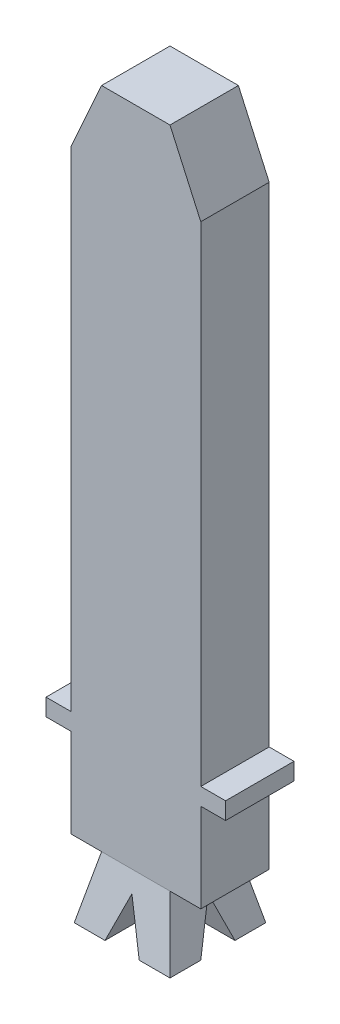
ISO-10303-21;
HEADER;
FILE_DESCRIPTION(('STEP AP214'),'2;1');
FILE_NAME('part.step','',(''),(''),'','','');
FILE_SCHEMA(('AUTOMOTIVE_DESIGN { 1 0 10303 214 1 1 1 1 }'));
ENDSEC;
DATA;
#1=APPLICATION_CONTEXT('core data for automotive mechanical design processes');
#2=APPLICATION_PROTOCOL_DEFINITION('international standard','automotive_design',2000,#1);
#3=PRODUCT_CONTEXT('',#1,'mechanical');
#4=PRODUCT('Part','Part','',(#3));
#5=PRODUCT_RELATED_PRODUCT_CATEGORY('part','',(#4));
#6=PRODUCT_DEFINITION_FORMATION('','',#4);
#7=PRODUCT_DEFINITION_CONTEXT('part definition',#1,'design');
#8=PRODUCT_DEFINITION('design','',#6,#7);
#9=PRODUCT_DEFINITION_SHAPE('','',#8);
#10=(LENGTH_UNIT() NAMED_UNIT(*) SI_UNIT(.MILLI.,.METRE.));
#11=(NAMED_UNIT(*) PLANE_ANGLE_UNIT() SI_UNIT($,.RADIAN.));
#12=(NAMED_UNIT(*) SI_UNIT($,.STERADIAN.) SOLID_ANGLE_UNIT());
#13=UNCERTAINTY_MEASURE_WITH_UNIT(LENGTH_MEASURE(1.E-05),#10,'distance_accuracy_value','');
#14=(GEOMETRIC_REPRESENTATION_CONTEXT(3) GLOBAL_UNCERTAINTY_ASSIGNED_CONTEXT((#13)) GLOBAL_UNIT_ASSIGNED_CONTEXT((#10,
#11,#12)) REPRESENTATION_CONTEXT('',''));
#15=CARTESIAN_POINT('',(0.,0.,0.));
#16=DIRECTION('',(0.,0.,1.));
#17=DIRECTION('',(1.,0.,0.));
#18=AXIS2_PLACEMENT_3D('',#15,#16,#17);
#19=CARTESIAN_POINT('',(0.,-4.9,0.));
#20=DIRECTION('',(0.,-1.,0.));
#21=DIRECTION('',(0.,0.,-1.));
#22=AXIS2_PLACEMENT_3D('',#19,#20,#21);
#23=PLANE('',#22);
#24=DIRECTION('',(-1.,0.,0.));
#25=VECTOR('',#24,1.);
#26=CARTESIAN_POINT('',(2.625,-4.9,1.5));
#27=LINE('',#26,#25);
#28=CARTESIAN_POINT('',(1.4,-4.9,1.5));
#29=VERTEX_POINT('',#28);
#30=CARTESIAN_POINT('',(0.5,-4.9,1.5));
#31=VERTEX_POINT('',#30);
#32=EDGE_CURVE('E480',#29,#31,#27,.T.);
#33=ORIENTED_EDGE('',*,*,#32,.F.);
#34=DIRECTION('',(0.,0.,1.));
#35=VECTOR('',#34,1.);
#36=CARTESIAN_POINT('',(1.4,-4.9,-0.4));
#37=LINE('',#36,#35);
#38=CARTESIAN_POINT('',(1.4,-4.9,2.4));
#39=VERTEX_POINT('',#38);
#40=EDGE_CURVE('E182',#29,#39,#37,.T.);
#41=ORIENTED_EDGE('',*,*,#40,.T.);
#42=DIRECTION('',(-1.,0.,0.));
#43=VECTOR('',#42,1.);
#44=CARTESIAN_POINT('',(1.4,-4.9,2.4));
#45=LINE('',#44,#43);
#46=CARTESIAN_POINT('',(0.500000000000001,-4.9,2.4));
#47=VERTEX_POINT('',#46);
#48=EDGE_CURVE('E357',#39,#47,#45,.T.);
#49=ORIENTED_EDGE('',*,*,#48,.T.);
#50=DIRECTION('',(0.,0.,1.));
#51=VECTOR('',#50,1.);
#52=CARTESIAN_POINT('',(0.500000000000001,-4.9,-0.4001));
#53=LINE('',#52,#51);
#54=EDGE_CURVE('E328',#31,#47,#53,.T.);
#55=ORIENTED_EDGE('',*,*,#54,.F.);
#56=EDGE_LOOP('',(#33,#41,#49,#55));
#57=FACE_BOUND('',#56,.T.);
#58=ADVANCED_FACE('F54',(#57),#23,.T.);
#59=CARTESIAN_POINT('',(-0.499999999999999,-4.9,1.5));
#60=VERTEX_POINT('',#59);
#61=CARTESIAN_POINT('',(-1.4,-4.9,1.5));
#62=VERTEX_POINT('',#61);
#63=EDGE_CURVE('E161',#60,#62,#27,.T.);
#64=ORIENTED_EDGE('',*,*,#63,.F.);
#65=DIRECTION('',(0.,0.,1.));
#66=VECTOR('',#65,1.);
#67=CARTESIAN_POINT('',(-0.499999999999999,-4.9,-0.4001));
#68=LINE('',#67,#66);
#69=CARTESIAN_POINT('',(-0.499999999999999,-4.9,2.4));
#70=VERTEX_POINT('',#69);
#71=EDGE_CURVE('E361',#60,#70,#68,.T.);
#72=ORIENTED_EDGE('',*,*,#71,.T.);
#73=CARTESIAN_POINT('',(-1.4,-4.9,2.4));
#74=VERTEX_POINT('',#73);
#75=EDGE_CURVE('E181',#70,#74,#45,.T.);
#76=ORIENTED_EDGE('',*,*,#75,.T.);
#77=DIRECTION('',(0.,0.,-1.));
#78=VECTOR('',#77,1.);
#79=CARTESIAN_POINT('',(-1.4,-4.9,-0.4));
#80=LINE('',#79,#78);
#81=EDGE_CURVE('E391',#74,#62,#80,.T.);
#82=ORIENTED_EDGE('',*,*,#81,.T.);
#83=EDGE_LOOP('',(#64,#72,#76,#82));
#84=FACE_BOUND('',#83,.T.);
#85=ADVANCED_FACE('F520',(#84),#23,.T.);
#86=CARTESIAN_POINT('',(0.500000000000001,-4.9,-0.4001));
#87=DIRECTION('',(0.932267960991806,0.361768501818747,0.));
#88=DIRECTION('',(-0.361768501818747,0.932267960991806,0.));
#89=AXIS2_PLACEMENT_3D('',#86,#87,#88);
#90=PLANE('',#89);
#91=DIRECTION('',(0.,0.,1.));
#92=VECTOR('',#91,1.);
#93=CARTESIAN_POINT('',(0.,-3.61151308598601,-0.4001));
#94=LINE('',#93,#92);
#95=CARTESIAN_POINT('',(0.,-3.611513085986,0.999999999999999));
#96=VERTEX_POINT('',#95);
#97=CARTESIAN_POINT('',(0.,-3.611513085986,2.11366957466356));
#98=VERTEX_POINT('',#97);
#99=EDGE_CURVE('E474',#96,#98,#94,.T.);
#100=ORIENTED_EDGE('',*,*,#99,.F.);
#101=DIRECTION('',(0.340191275432694,-0.876664013313512,0.340191275432694));
#102=VECTOR('',#101,1.);
#103=CARTESIAN_POINT('',(0.280101229616619,-4.33332662390649,1.28010122961662));
#104=LINE('',#103,#102);
#105=EDGE_CURVE('E173',#96,#31,#104,.T.);
#106=ORIENTED_EDGE('',*,*,#105,.T.);
#107=ORIENTED_EDGE('',*,*,#54,.T.);
#108=DIRECTION('',(0.354246297399246,-0.912883437073675,0.202862986016372));
#109=VECTOR('',#108,1.);
#110=CARTESIAN_POINT('',(-1.3198068575803,-0.210405355949719,1.35786785687772));
#111=LINE('',#110,#109);
#112=EDGE_CURVE('E321',#98,#47,#111,.T.);
#113=ORIENTED_EDGE('',*,*,#112,.F.);
#114=EDGE_LOOP('',(#100,#106,#107,#113));
#115=FACE_BOUND('',#114,.T.);
#116=ADVANCED_FACE('F477',(#115),#90,.F.);
#117=CARTESIAN_POINT('',(0.,-3.61151308598601,-0.4001));
#118=DIRECTION('',(-0.932267960991806,0.361768501818746,0.));
#119=DIRECTION('',(-0.361768501818746,-0.932267960991806,0.));
#120=AXIS2_PLACEMENT_3D('',#117,#118,#119);
#121=PLANE('',#120);
#122=ORIENTED_EDGE('',*,*,#71,.F.);
#123=DIRECTION('',(0.340191275432693,0.876664013313513,-0.340191275432694));
#124=VECTOR('',#123,1.);
#125=CARTESIAN_POINT('',(0.16203371844312,-3.19395643430003,0.837966281556879));
#126=LINE('',#125,#124);
#127=EDGE_CURVE('E13',#60,#96,#126,.T.);
#128=ORIENTED_EDGE('',*,*,#127,.T.);
#129=ORIENTED_EDGE('',*,*,#99,.T.);
#130=DIRECTION('',(0.354246297399245,0.912883437073675,-0.202862986016372));
#131=VECTOR('',#130,1.);
#132=CARTESIAN_POINT('',(1.3198068575803,-0.210405355949717,1.35786785687771));
#133=LINE('',#132,#131);
#134=EDGE_CURVE('E324',#70,#98,#133,.T.);
#135=ORIENTED_EDGE('',*,*,#134,.F.);
#136=EDGE_LOOP('',(#122,#128,#129,#135));
#137=FACE_BOUND('',#136,.T.);
#138=ADVANCED_FACE('F472',(#137),#121,.F.);
#139=DIRECTION('',(-1.,0.,0.));
#140=VECTOR('',#139,1.);
#141=CARTESIAN_POINT('',(2.625,-4.9,0.499999999999999));
#142=LINE('',#141,#140);
#143=CARTESIAN_POINT('',(1.4,-4.9,0.499999999999999));
#144=VERTEX_POINT('',#143);
#145=CARTESIAN_POINT('',(0.5,-4.9,0.499999999999999));
#146=VERTEX_POINT('',#145);
#147=EDGE_CURVE('E150',#144,#146,#142,.T.);
#148=ORIENTED_EDGE('',*,*,#147,.T.);
#149=CARTESIAN_POINT('',(0.500000000000001,-4.9,-0.4));
#150=VERTEX_POINT('',#149);
#151=EDGE_CURVE('E325',#150,#146,#53,.T.);
#152=ORIENTED_EDGE('',*,*,#151,.F.);
#153=DIRECTION('',(1.,0.,0.));
#154=VECTOR('',#153,1.);
#155=CARTESIAN_POINT('',(1.4,-4.9,-0.4));
#156=LINE('',#155,#154);
#157=CARTESIAN_POINT('',(1.4,-4.9,-0.4));
#158=VERTEX_POINT('',#157);
#159=EDGE_CURVE('E179',#150,#158,#156,.T.);
#160=ORIENTED_EDGE('',*,*,#159,.T.);
#161=EDGE_CURVE('E169',#158,#144,#37,.T.);
#162=ORIENTED_EDGE('',*,*,#161,.T.);
#163=EDGE_LOOP('',(#148,#152,#160,#162));
#164=FACE_BOUND('',#163,.T.);
#165=ADVANCED_FACE('F177',(#164),#23,.T.);
#166=CARTESIAN_POINT('',(-0.499999999999999,-4.9,0.499999999999999));
#167=VERTEX_POINT('',#166);
#168=CARTESIAN_POINT('',(-1.4,-4.9,0.499999999999999));
#169=VERTEX_POINT('',#168);
#170=EDGE_CURVE('E73',#167,#169,#142,.T.);
#171=ORIENTED_EDGE('',*,*,#170,.T.);
#172=CARTESIAN_POINT('',(-1.4,-4.9,-0.4));
#173=VERTEX_POINT('',#172);
#174=EDGE_CURVE('E59',#169,#173,#80,.T.);
#175=ORIENTED_EDGE('',*,*,#174,.T.);
#176=CARTESIAN_POINT('',(-0.499999999999999,-4.9,-0.4));
#177=VERTEX_POINT('',#176);
#178=EDGE_CURVE('E251',#173,#177,#156,.T.);
#179=ORIENTED_EDGE('',*,*,#178,.T.);
#180=EDGE_CURVE('E80',#177,#167,#68,.T.);
#181=ORIENTED_EDGE('',*,*,#180,.T.);
#182=EDGE_LOOP('',(#171,#175,#179,#181));
#183=FACE_BOUND('',#182,.T.);
#184=ADVANCED_FACE('F56',(#183),#23,.T.);
#185=CARTESIAN_POINT('',(0.,-3.1,0.));
#186=DIRECTION('',(0.,-1.,0.));
#187=DIRECTION('',(0.,0.,-1.));
#188=AXIS2_PLACEMENT_3D('',#185,#186,#187);
#189=PLANE('',#188);
#190=DIRECTION('',(0.,0.,-1.));
#191=VECTOR('',#190,1.);
#192=CARTESIAN_POINT('',(-1.,-3.1,2.));
#193=LINE('',#192,#191);
#194=CARTESIAN_POINT('',(-1.,-3.1,2.));
#195=VERTEX_POINT('',#194);
#196=CARTESIAN_POINT('',(-1.,-3.1,0.));
#197=VERTEX_POINT('',#196);
#198=EDGE_CURVE('E299',#195,#197,#193,.T.);
#199=ORIENTED_EDGE('',*,*,#198,.F.);
#200=DIRECTION('',(-1.,0.,0.));
#201=VECTOR('',#200,1.);
#202=CARTESIAN_POINT('',(-1.,-3.1,2.));
#203=LINE('',#202,#201);
#204=CARTESIAN_POINT('',(1.,-3.1,2.));
#205=VERTEX_POINT('',#204);
#206=EDGE_CURVE('E304',#205,#195,#203,.T.);
#207=ORIENTED_EDGE('',*,*,#206,.F.);
#208=DIRECTION('',(0.,0.,1.));
#209=VECTOR('',#208,1.);
#210=CARTESIAN_POINT('',(1.,-3.1,2.));
#211=LINE('',#210,#209);
#212=CARTESIAN_POINT('',(1.,-3.1,0.));
#213=VERTEX_POINT('',#212);
#214=EDGE_CURVE('E407',#213,#205,#211,.T.);
#215=ORIENTED_EDGE('',*,*,#214,.F.);
#216=DIRECTION('',(1.,0.,0.));
#217=VECTOR('',#216,1.);
#218=CARTESIAN_POINT('',(-1.,-3.1,0.));
#219=LINE('',#218,#217);
#220=EDGE_CURVE('E439',#197,#213,#219,.T.);
#221=ORIENTED_EDGE('',*,*,#220,.F.);
#222=EDGE_LOOP('',(#199,#207,#215,#221));
#223=FACE_BOUND('',#222,.T.);
#224=ADVANCED_FACE('F417',(#223),#189,.F.);
#225=CARTESIAN_POINT('',(0.,0.277647058823529,1.24941176470588));
#226=DIRECTION('',(0.,-0.216930457818656,-0.976187060183953));
#227=DIRECTION('',(0.,0.976187060183953,-0.216930457818656));
#228=AXIS2_PLACEMENT_3D('',#225,#226,#227);
#229=PLANE('',#228);
#230=ORIENTED_EDGE('',*,*,#134,.T.);
#231=ORIENTED_EDGE('',*,*,#112,.T.);
#232=ORIENTED_EDGE('',*,*,#48,.F.);
#233=DIRECTION('',(0.211999576001272,-0.953998092005724,0.211999576001272));
#234=VECTOR('',#233,1.);
#235=CARTESIAN_POINT('',(1.,-3.1,2.));
#236=LINE('',#235,#234);
#237=EDGE_CURVE('E281',#205,#39,#236,.T.);
#238=ORIENTED_EDGE('',*,*,#237,.F.);
#239=ORIENTED_EDGE('',*,*,#206,.T.);
#240=DIRECTION('',(-0.211999576001272,-0.953998092005724,0.211999576001272));
#241=VECTOR('',#240,1.);
#242=CARTESIAN_POINT('',(-1.,-3.1,2.));
#243=LINE('',#242,#241);
#244=EDGE_CURVE('E285',#195,#74,#243,.T.);
#245=ORIENTED_EDGE('',*,*,#244,.T.);
#246=ORIENTED_EDGE('',*,*,#75,.F.);
#247=EDGE_LOOP('',(#230,#231,#232,#238,#239,#245,#246));
#248=FACE_BOUND('',#247,.T.);
#249=ADVANCED_FACE('F230',(#248),#229,.F.);
#250=CARTESIAN_POINT('',(0.296470588235295,0.0658823529411766,0.));
#251=DIRECTION('',(-0.976187060183953,-0.216930457818656,0.));
#252=DIRECTION('',(0.216930457818656,-0.976187060183953,0.));
#253=AXIS2_PLACEMENT_3D('',#250,#251,#252);
#254=PLANE('',#253);
#255=ORIENTED_EDGE('',*,*,#40,.F.);
#256=DIRECTION('',(-0.202862986016372,0.912883437073675,-0.354246297399246));
#257=VECTOR('',#256,1.);
#258=CARTESIAN_POINT('',(0.32715778629754,-0.0722100383389264,-0.373433835125718));
#259=LINE('',#258,#257);
#260=CARTESIAN_POINT('',(1.11366957466356,-3.611513085986,0.999999999999998));
#261=VERTEX_POINT('',#260);
#262=EDGE_CURVE('E172',#29,#261,#259,.T.);
#263=ORIENTED_EDGE('',*,*,#262,.T.);
#264=DIRECTION('',(0.202862986016372,-0.912883437073675,-0.354246297399245));
#265=VECTOR('',#264,1.);
#266=CARTESIAN_POINT('',(0.470884709648849,-0.718981193419817,2.12245295668356));
#267=LINE('',#266,#265);
#268=EDGE_CURVE('E153',#261,#144,#267,.T.);
#269=ORIENTED_EDGE('',*,*,#268,.T.);
#270=ORIENTED_EDGE('',*,*,#161,.F.);
#271=DIRECTION('',(0.211999576001272,-0.953998092005724,-0.211999576001272));
#272=VECTOR('',#271,1.);
#273=CARTESIAN_POINT('',(1.,-3.1,0.));
#274=LINE('',#273,#272);
#275=EDGE_CURVE('E272',#213,#158,#274,.T.);
#276=ORIENTED_EDGE('',*,*,#275,.F.);
#277=ORIENTED_EDGE('',*,*,#214,.T.);
#278=ORIENTED_EDGE('',*,*,#237,.T.);
#279=EDGE_LOOP('',(#255,#263,#269,#270,#276,#277,#278));
#280=FACE_BOUND('',#279,.T.);
#281=ADVANCED_FACE('F167',(#280),#254,.F.);
#282=CARTESIAN_POINT('',(-0.296470588235294,0.0658823529411765,0.));
#283=DIRECTION('',(0.976187060183953,-0.216930457818656,0.));
#284=DIRECTION('',(0.216930457818656,0.976187060183953,0.));
#285=AXIS2_PLACEMENT_3D('',#282,#283,#284);
#286=PLANE('',#285);
#287=DIRECTION('',(0.202862986016372,0.912883437073675,0.354246297399245));
#288=VECTOR('',#287,1.);
#289=CARTESIAN_POINT('',(-0.470884709648848,-0.718981193419817,2.12245295668357));
#290=LINE('',#289,#288);
#291=CARTESIAN_POINT('',(-1.11366957466356,-3.611513085986,0.999999999999999));
#292=VERTEX_POINT('',#291);
#293=EDGE_CURVE('E174',#169,#292,#290,.T.);
#294=ORIENTED_EDGE('',*,*,#293,.T.);
#295=DIRECTION('',(-0.202862986016372,-0.912883437073675,0.354246297399246));
#296=VECTOR('',#295,1.);
#297=CARTESIAN_POINT('',(-0.327157786297539,-0.0722100383389265,-0.373433835125718));
#298=LINE('',#297,#296);
#299=EDGE_CURVE('E502',#292,#62,#298,.T.);
#300=ORIENTED_EDGE('',*,*,#299,.T.);
#301=ORIENTED_EDGE('',*,*,#81,.F.);
#302=ORIENTED_EDGE('',*,*,#244,.F.);
#303=ORIENTED_EDGE('',*,*,#198,.T.);
#304=DIRECTION('',(-0.211999576001272,-0.953998092005724,-0.211999576001272));
#305=VECTOR('',#304,1.);
#306=CARTESIAN_POINT('',(-1.,-3.1,0.));
#307=LINE('',#306,#305);
#308=EDGE_CURVE('E278',#197,#173,#307,.T.);
#309=ORIENTED_EDGE('',*,*,#308,.T.);
#310=ORIENTED_EDGE('',*,*,#174,.F.);
#311=EDGE_LOOP('',(#294,#300,#301,#302,#303,#309,#310));
#312=FACE_BOUND('',#311,.T.);
#313=ADVANCED_FACE('F229',(#312),#286,.F.);
#314=CARTESIAN_POINT('',(0.,-0.145882352941177,0.656470588235294));
#315=DIRECTION('',(0.,-0.216930457818656,0.976187060183953));
#316=DIRECTION('',(0.,-0.976187060183953,-0.216930457818656));
#317=AXIS2_PLACEMENT_3D('',#314,#315,#316);
#318=PLANE('',#317);
#319=ORIENTED_EDGE('',*,*,#159,.F.);
#320=DIRECTION('',(-0.354246297399246,0.912883437073675,0.202862986016372));
#321=VECTOR('',#320,1.);
#322=CARTESIAN_POINT('',(-1.17607993422899,-0.580785875809028,0.559825360931327));
#323=LINE('',#322,#321);
#324=CARTESIAN_POINT('',(0.,-3.611513085986,-0.113669574663557));
#325=VERTEX_POINT('',#324);
#326=EDGE_CURVE('E363',#150,#325,#323,.T.);
#327=ORIENTED_EDGE('',*,*,#326,.T.);
#328=DIRECTION('',(-0.354246297399245,-0.912883437073675,-0.202862986016372));
#329=VECTOR('',#328,1.);
#330=CARTESIAN_POINT('',(1.17607993422899,-0.580785875809026,0.559825360931328));
#331=LINE('',#330,#329);
#332=EDGE_CURVE('E366',#325,#177,#331,.T.);
#333=ORIENTED_EDGE('',*,*,#332,.T.);
#334=ORIENTED_EDGE('',*,*,#178,.F.);
#335=ORIENTED_EDGE('',*,*,#308,.F.);
#336=ORIENTED_EDGE('',*,*,#220,.T.);
#337=ORIENTED_EDGE('',*,*,#275,.T.);
#338=EDGE_LOOP('',(#319,#327,#333,#334,#335,#336,#337));
#339=FACE_BOUND('',#338,.T.);
#340=ADVANCED_FACE('F255',(#339),#318,.F.);
#341=ORIENTED_EDGE('',*,*,#151,.T.);
#342=DIRECTION('',(-0.340191275432694,0.876664013313513,0.340191275432693));
#343=VECTOR('',#342,1.);
#344=CARTESIAN_POINT('',(0.604168666502859,-5.16843992727844,0.395831333497141));
#345=LINE('',#344,#343);
#346=EDGE_CURVE('E156',#146,#96,#345,.T.);
#347=ORIENTED_EDGE('',*,*,#346,.T.);
#348=EDGE_CURVE('E362',#325,#96,#94,.T.);
#349=ORIENTED_EDGE('',*,*,#348,.F.);
#350=ORIENTED_EDGE('',*,*,#326,.F.);
#351=EDGE_LOOP('',(#341,#347,#349,#350));
#352=FACE_BOUND('',#351,.T.);
#353=ADVANCED_FACE('F263',(#352),#90,.F.);
#354=ORIENTED_EDGE('',*,*,#348,.T.);
#355=DIRECTION('',(-0.340191275432693,-0.876664013313513,-0.340191275432693));
#356=VECTOR('',#355,1.);
#357=CARTESIAN_POINT('',(-0.16203371844312,-4.02906973767198,0.837966281556879));
#358=LINE('',#357,#356);
#359=EDGE_CURVE('E65',#96,#167,#358,.T.);
#360=ORIENTED_EDGE('',*,*,#359,.T.);
#361=ORIENTED_EDGE('',*,*,#180,.F.);
#362=ORIENTED_EDGE('',*,*,#332,.F.);
#363=EDGE_LOOP('',(#354,#360,#361,#362));
#364=FACE_BOUND('',#363,.T.);
#365=ADVANCED_FACE('F531',(#364),#121,.F.);
#366=CARTESIAN_POINT('',(2.625,-3.611513085986,0.999999999999999));
#367=DIRECTION('',(0.,0.361768501818746,-0.932267960991806));
#368=DIRECTION('',(0.,0.932267960991806,0.361768501818746));
#369=AXIS2_PLACEMENT_3D('',#366,#367,#368);
#370=PLANE('',#369);
#371=ORIENTED_EDGE('',*,*,#170,.F.);
#372=ORIENTED_EDGE('',*,*,#359,.F.);
#373=DIRECTION('',(-1.,0.,0.));
#374=VECTOR('',#373,1.);
#375=CARTESIAN_POINT('',(2.625,-3.611513085986,0.999999999999999));
#376=LINE('',#375,#374);
#377=EDGE_CURVE('E494',#96,#292,#376,.T.);
#378=ORIENTED_EDGE('',*,*,#377,.T.);
#379=ORIENTED_EDGE('',*,*,#293,.F.);
#380=EDGE_LOOP('',(#371,#372,#378,#379));
#381=FACE_BOUND('',#380,.T.);
#382=ADVANCED_FACE('F504',(#381),#370,.F.);
#383=CARTESIAN_POINT('',(2.625,-4.9,1.5));
#384=DIRECTION('',(0.,0.361768501818747,0.932267960991806));
#385=DIRECTION('',(0.,-0.932267960991806,0.361768501818747));
#386=AXIS2_PLACEMENT_3D('',#383,#384,#385);
#387=PLANE('',#386);
#388=ORIENTED_EDGE('',*,*,#377,.F.);
#389=ORIENTED_EDGE('',*,*,#127,.F.);
#390=ORIENTED_EDGE('',*,*,#63,.T.);
#391=ORIENTED_EDGE('',*,*,#299,.F.);
#392=EDGE_LOOP('',(#388,#389,#390,#391));
#393=FACE_BOUND('',#392,.T.);
#394=ADVANCED_FACE('F512',(#393),#387,.F.);
#395=ORIENTED_EDGE('',*,*,#32,.T.);
#396=ORIENTED_EDGE('',*,*,#105,.F.);
#397=EDGE_CURVE('E497',#261,#96,#376,.T.);
#398=ORIENTED_EDGE('',*,*,#397,.F.);
#399=ORIENTED_EDGE('',*,*,#262,.F.);
#400=EDGE_LOOP('',(#395,#396,#398,#399));
#401=FACE_BOUND('',#400,.T.);
#402=ADVANCED_FACE('F507',(#401),#387,.F.);
#403=ORIENTED_EDGE('',*,*,#397,.T.);
#404=ORIENTED_EDGE('',*,*,#346,.F.);
#405=ORIENTED_EDGE('',*,*,#147,.F.);
#406=ORIENTED_EDGE('',*,*,#268,.F.);
#407=EDGE_LOOP('',(#403,#404,#405,#406));
#408=FACE_BOUND('',#407,.T.);
#409=ADVANCED_FACE('F152',(#408),#370,.F.);
#410=CLOSED_SHELL('',(#58,#85,#116,#138,#165,#184,#224,#249,#281,#313,#340,#353,#365,#382,#394,
#402,#409));
#411=MANIFOLD_SOLID_BREP('B2',#410);
#412=CARTESIAN_POINT('',(-1.9,14.3,2.));
#413=DIRECTION('',(0.911921505175107,-0.410364677328798,0.));
#414=DIRECTION('',(0.410364677328798,0.911921505175107,0.));
#415=AXIS2_PLACEMENT_3D('',#412,#413,#414);
#416=PLANE('',#415);
#417=DIRECTION('',(-0.410364677328797,-0.911921505175106,0.));
#418=VECTOR('',#417,1.);
#419=CARTESIAN_POINT('',(-1.9,14.3,0.));
#420=LINE('',#419,#418);
#421=CARTESIAN_POINT('',(-1.,16.3,0.));
#422=VERTEX_POINT('',#421);
#423=CARTESIAN_POINT('',(-1.9,14.3,0.));
#424=VERTEX_POINT('',#423);
#425=EDGE_CURVE('E804',#422,#424,#420,.T.);
#426=ORIENTED_EDGE('',*,*,#425,.T.);
#427=DIRECTION('',(0.,0.,-1.));
#428=VECTOR('',#427,1.);
#429=CARTESIAN_POINT('',(-1.9,14.3,2.));
#430=LINE('',#429,#428);
#431=CARTESIAN_POINT('',(-1.9,14.3,2.));
#432=VERTEX_POINT('',#431);
#433=EDGE_CURVE('E52',#432,#424,#430,.T.);
#434=ORIENTED_EDGE('',*,*,#433,.F.);
#435=DIRECTION('',(-0.410364677328797,-0.911921505175106,0.));
#436=VECTOR('',#435,1.);
#437=CARTESIAN_POINT('',(-1.9,14.3,2.));
#438=LINE('',#437,#436);
#439=CARTESIAN_POINT('',(-1.,16.3,2.));
#440=VERTEX_POINT('',#439);
#441=EDGE_CURVE('E830',#440,#432,#438,.T.);
#442=ORIENTED_EDGE('',*,*,#441,.F.);
#443=DIRECTION('',(0.,0.,-1.));
#444=VECTOR('',#443,1.);
#445=CARTESIAN_POINT('',(-1.,16.3,2.));
#446=LINE('',#445,#444);
#447=EDGE_CURVE('E800',#440,#422,#446,.T.);
#448=ORIENTED_EDGE('',*,*,#447,.T.);
#449=EDGE_LOOP('',(#426,#434,#442,#448));
#450=FACE_BOUND('',#449,.T.);
#451=ADVANCED_FACE('F672',(#450),#416,.F.);
#452=CARTESIAN_POINT('',(-1.9,14.3,2.));
#453=DIRECTION('',(1.,0.,0.));
#454=DIRECTION('',(0.,1.,0.));
#455=AXIS2_PLACEMENT_3D('',#452,#453,#454);
#456=PLANE('',#455);
#457=DIRECTION('',(0.,-1.,0.));
#458=VECTOR('',#457,1.);
#459=CARTESIAN_POINT('',(-1.9,14.3,0.));
#460=LINE('',#459,#458);
#461=CARTESIAN_POINT('',(-1.9,0.,0.));
#462=VERTEX_POINT('',#461);
#463=EDGE_CURVE('E807',#424,#462,#460,.T.);
#464=ORIENTED_EDGE('',*,*,#463,.T.);
#465=DIRECTION('',(0.,0.,-1.));
#466=VECTOR('',#465,1.);
#467=CARTESIAN_POINT('',(-1.9,0.,2.));
#468=LINE('',#467,#466);
#469=CARTESIAN_POINT('',(-1.9,0.,2.));
#470=VERTEX_POINT('',#469);
#471=EDGE_CURVE('E680',#470,#462,#468,.T.);
#472=ORIENTED_EDGE('',*,*,#471,.F.);
#473=DIRECTION('',(0.,-1.,0.));
#474=VECTOR('',#473,1.);
#475=CARTESIAN_POINT('',(-1.9,14.3,2.));
#476=LINE('',#475,#474);
#477=EDGE_CURVE('E749',#432,#470,#476,.T.);
#478=ORIENTED_EDGE('',*,*,#477,.F.);
#479=ORIENTED_EDGE('',*,*,#433,.T.);
#480=EDGE_LOOP('',(#464,#472,#478,#479));
#481=FACE_BOUND('',#480,.T.);
#482=ADVANCED_FACE('F918',(#481),#456,.F.);
#483=CARTESIAN_POINT('',(-2.625,0.,2.));
#484=DIRECTION('',(0.,-1.,0.));
#485=DIRECTION('',(1.,0.,0.));
#486=AXIS2_PLACEMENT_3D('',#483,#484,#485);
#487=PLANE('',#486);
#488=DIRECTION('',(-1.,0.,0.));
#489=VECTOR('',#488,1.);
#490=CARTESIAN_POINT('',(-2.625,0.,0.));
#491=LINE('',#490,#489);
#492=CARTESIAN_POINT('',(-2.625,0.,0.));
#493=VERTEX_POINT('',#492);
#494=EDGE_CURVE('E809',#462,#493,#491,.T.);
#495=ORIENTED_EDGE('',*,*,#494,.T.);
#496=DIRECTION('',(0.,0.,-1.));
#497=VECTOR('',#496,1.);
#498=CARTESIAN_POINT('',(-2.625,0.,2.));
#499=LINE('',#498,#497);
#500=CARTESIAN_POINT('',(-2.625,0.,2.));
#501=VERTEX_POINT('',#500);
#502=EDGE_CURVE('E855',#501,#493,#499,.T.);
#503=ORIENTED_EDGE('',*,*,#502,.F.);
#504=DIRECTION('',(-1.,0.,0.));
#505=VECTOR('',#504,1.);
#506=CARTESIAN_POINT('',(-2.625,0.,2.));
#507=LINE('',#506,#505);
#508=EDGE_CURVE('E863',#470,#501,#507,.T.);
#509=ORIENTED_EDGE('',*,*,#508,.F.);
#510=ORIENTED_EDGE('',*,*,#471,.T.);
#511=EDGE_LOOP('',(#495,#503,#509,#510));
#512=FACE_BOUND('',#511,.T.);
#513=ADVANCED_FACE('F861',(#512),#487,.F.);
#514=CARTESIAN_POINT('',(-2.625,0.,2.));
#515=DIRECTION('',(1.,0.,0.));
#516=DIRECTION('',(0.,0.,-1.));
#517=AXIS2_PLACEMENT_3D('',#514,#515,#516);
#518=PLANE('',#517);
#519=DIRECTION('',(0.,-1.,0.));
#520=VECTOR('',#519,1.);
#521=CARTESIAN_POINT('',(-2.625,0.,0.));
#522=LINE('',#521,#520);
#523=CARTESIAN_POINT('',(-2.625,-0.5,0.));
#524=VERTEX_POINT('',#523);
#525=EDGE_CURVE('E811',#493,#524,#522,.T.);
#526=ORIENTED_EDGE('',*,*,#525,.T.);
#527=DIRECTION('',(0.,0.,-1.));
#528=VECTOR('',#527,1.);
#529=CARTESIAN_POINT('',(-2.625,-0.5,2.));
#530=LINE('',#529,#528);
#531=CARTESIAN_POINT('',(-2.625,-0.5,2.));
#532=VERTEX_POINT('',#531);
#533=EDGE_CURVE('E852',#532,#524,#530,.T.);
#534=ORIENTED_EDGE('',*,*,#533,.F.);
#535=DIRECTION('',(0.,-1.,0.));
#536=VECTOR('',#535,1.);
#537=CARTESIAN_POINT('',(-2.625,0.,2.));
#538=LINE('',#537,#536);
#539=EDGE_CURVE('E881',#501,#532,#538,.T.);
#540=ORIENTED_EDGE('',*,*,#539,.F.);
#541=ORIENTED_EDGE('',*,*,#502,.T.);
#542=EDGE_LOOP('',(#526,#534,#540,#541));
#543=FACE_BOUND('',#542,.T.);
#544=ADVANCED_FACE('F872',(#543),#518,.F.);
#545=CARTESIAN_POINT('',(-2.625,-0.5,2.));
#546=DIRECTION('',(0.,1.,0.));
#547=DIRECTION('',(0.,0.,1.));
#548=AXIS2_PLACEMENT_3D('',#545,#546,#547);
#549=PLANE('',#548);
#550=DIRECTION('',(1.,0.,0.));
#551=VECTOR('',#550,1.);
#552=CARTESIAN_POINT('',(-2.625,-0.5,0.));
#553=LINE('',#552,#551);
#554=CARTESIAN_POINT('',(-1.9,-0.5,0.));
#555=VERTEX_POINT('',#554);
#556=EDGE_CURVE('E813',#524,#555,#553,.T.);
#557=ORIENTED_EDGE('',*,*,#556,.T.);
#558=DIRECTION('',(0.,0.,-1.));
#559=VECTOR('',#558,1.);
#560=CARTESIAN_POINT('',(-1.9,-0.5,2.));
#561=LINE('',#560,#559);
#562=CARTESIAN_POINT('',(-1.9,-0.5,2.));
#563=VERTEX_POINT('',#562);
#564=EDGE_CURVE('E849',#563,#555,#561,.T.);
#565=ORIENTED_EDGE('',*,*,#564,.F.);
#566=DIRECTION('',(1.,0.,0.));
#567=VECTOR('',#566,1.);
#568=CARTESIAN_POINT('',(-2.625,-0.5,2.));
#569=LINE('',#568,#567);
#570=EDGE_CURVE('E878',#532,#563,#569,.T.);
#571=ORIENTED_EDGE('',*,*,#570,.F.);
#572=ORIENTED_EDGE('',*,*,#533,.T.);
#573=EDGE_LOOP('',(#557,#565,#571,#572));
#574=FACE_BOUND('',#573,.T.);
#575=ADVANCED_FACE('F876',(#574),#549,.F.);
#576=CARTESIAN_POINT('',(-1.9,-0.5,2.));
#577=DIRECTION('',(1.,0.,0.));
#578=DIRECTION('',(0.,1.,0.));
#579=AXIS2_PLACEMENT_3D('',#576,#577,#578);
#580=PLANE('',#579);
#581=DIRECTION('',(0.,-1.,0.));
#582=VECTOR('',#581,1.);
#583=CARTESIAN_POINT('',(-1.9,-0.5,0.));
#584=LINE('',#583,#582);
#585=CARTESIAN_POINT('',(-1.9,-3.1,0.));
#586=VERTEX_POINT('',#585);
#587=EDGE_CURVE('E815',#555,#586,#584,.T.);
#588=ORIENTED_EDGE('',*,*,#587,.T.);
#589=DIRECTION('',(0.,0.,-1.));
#590=VECTOR('',#589,1.);
#591=CARTESIAN_POINT('',(-1.9,-3.1,2.));
#592=LINE('',#591,#590);
#593=CARTESIAN_POINT('',(-1.9,-3.1,2.));
#594=VERTEX_POINT('',#593);
#595=EDGE_CURVE('E846',#594,#586,#592,.T.);
#596=ORIENTED_EDGE('',*,*,#595,.F.);
#597=DIRECTION('',(0.,-1.,0.));
#598=VECTOR('',#597,1.);
#599=CARTESIAN_POINT('',(-1.9,-0.5,2.));
#600=LINE('',#599,#598);
#601=EDGE_CURVE('E880',#563,#594,#600,.T.);
#602=ORIENTED_EDGE('',*,*,#601,.F.);
#603=ORIENTED_EDGE('',*,*,#564,.T.);
#604=EDGE_LOOP('',(#588,#596,#602,#603));
#605=FACE_BOUND('',#604,.T.);
#606=ADVANCED_FACE('F931',(#605),#580,.F.);
#607=CARTESIAN_POINT('',(-1.9,-3.1,2.));
#608=DIRECTION('',(0.,1.,0.));
#609=DIRECTION('',(0.,0.,1.));
#610=AXIS2_PLACEMENT_3D('',#607,#608,#609);
#611=PLANE('',#610);
#612=DIRECTION('',(1.,0.,0.));
#613=VECTOR('',#612,1.);
#614=CARTESIAN_POINT('',(-1.9,-3.1,0.));
#615=LINE('',#614,#613);
#616=CARTESIAN_POINT('',(1.9,-3.1,0.));
#617=VERTEX_POINT('',#616);
#618=EDGE_CURVE('E817',#586,#617,#615,.T.);
#619=ORIENTED_EDGE('',*,*,#618,.T.);
#620=DIRECTION('',(0.,0.,-1.));
#621=VECTOR('',#620,1.);
#622=CARTESIAN_POINT('',(1.9,-3.1,2.));
#623=LINE('',#622,#621);
#624=CARTESIAN_POINT('',(1.9,-3.1,2.));
#625=VERTEX_POINT('',#624);
#626=EDGE_CURVE('E843',#625,#617,#623,.T.);
#627=ORIENTED_EDGE('',*,*,#626,.F.);
#628=DIRECTION('',(1.,0.,0.));
#629=VECTOR('',#628,1.);
#630=CARTESIAN_POINT('',(-1.9,-3.1,2.));
#631=LINE('',#630,#629);
#632=EDGE_CURVE('E883',#594,#625,#631,.T.);
#633=ORIENTED_EDGE('',*,*,#632,.F.);
#634=ORIENTED_EDGE('',*,*,#595,.T.);
#635=EDGE_LOOP('',(#619,#627,#633,#634));
#636=FACE_BOUND('',#635,.T.);
#637=ADVANCED_FACE('F934',(#636),#611,.F.);
#638=CARTESIAN_POINT('',(1.9,-0.5,2.));
#639=DIRECTION('',(-1.,0.,0.));
#640=DIRECTION('',(0.,-1.,0.));
#641=AXIS2_PLACEMENT_3D('',#638,#639,#640);
#642=PLANE('',#641);
#643=DIRECTION('',(0.,1.,0.));
#644=VECTOR('',#643,1.);
#645=CARTESIAN_POINT('',(1.9,-0.5,0.));
#646=LINE('',#645,#644);
#647=CARTESIAN_POINT('',(1.9,-0.5,0.));
#648=VERTEX_POINT('',#647);
#649=EDGE_CURVE('E819',#617,#648,#646,.T.);
#650=ORIENTED_EDGE('',*,*,#649,.T.);
#651=DIRECTION('',(0.,0.,-1.));
#652=VECTOR('',#651,1.);
#653=CARTESIAN_POINT('',(1.9,-0.5,2.));
#654=LINE('',#653,#652);
#655=CARTESIAN_POINT('',(1.9,-0.5,2.));
#656=VERTEX_POINT('',#655);
#657=EDGE_CURVE('E840',#656,#648,#654,.T.);
#658=ORIENTED_EDGE('',*,*,#657,.F.);
#659=DIRECTION('',(0.,1.,0.));
#660=VECTOR('',#659,1.);
#661=CARTESIAN_POINT('',(1.9,-0.5,2.));
#662=LINE('',#661,#660);
#663=EDGE_CURVE('E889',#625,#656,#662,.T.);
#664=ORIENTED_EDGE('',*,*,#663,.F.);
#665=ORIENTED_EDGE('',*,*,#626,.T.);
#666=EDGE_LOOP('',(#650,#658,#664,#665));
#667=FACE_BOUND('',#666,.T.);
#668=ADVANCED_FACE('F938',(#667),#642,.F.);
#669=CARTESIAN_POINT('',(1.9,-0.5,2.));
#670=DIRECTION('',(0.,1.,0.));
#671=DIRECTION('',(0.,0.,1.));
#672=AXIS2_PLACEMENT_3D('',#669,#670,#671);
#673=PLANE('',#672);
#674=DIRECTION('',(1.,0.,0.));
#675=VECTOR('',#674,1.);
#676=CARTESIAN_POINT('',(1.9,-0.5,0.));
#677=LINE('',#676,#675);
#678=CARTESIAN_POINT('',(2.625,-0.5,0.));
#679=VERTEX_POINT('',#678);
#680=EDGE_CURVE('E821',#648,#679,#677,.T.);
#681=ORIENTED_EDGE('',*,*,#680,.T.);
#682=DIRECTION('',(0.,0.,-1.));
#683=VECTOR('',#682,1.);
#684=CARTESIAN_POINT('',(2.625,-0.5,2.));
#685=LINE('',#684,#683);
#686=CARTESIAN_POINT('',(2.625,-0.5,2.));
#687=VERTEX_POINT('',#686);
#688=EDGE_CURVE('E837',#687,#679,#685,.T.);
#689=ORIENTED_EDGE('',*,*,#688,.F.);
#690=DIRECTION('',(1.,0.,0.));
#691=VECTOR('',#690,1.);
#692=CARTESIAN_POINT('',(1.9,-0.5,2.));
#693=LINE('',#692,#691);
#694=EDGE_CURVE('E891',#656,#687,#693,.T.);
#695=ORIENTED_EDGE('',*,*,#694,.F.);
#696=ORIENTED_EDGE('',*,*,#657,.T.);
#697=EDGE_LOOP('',(#681,#689,#695,#696));
#698=FACE_BOUND('',#697,.T.);
#699=ADVANCED_FACE('F942',(#698),#673,.F.);
#700=CARTESIAN_POINT('',(2.625,0.,2.));
#701=DIRECTION('',(-1.,0.,0.));
#702=DIRECTION('',(0.,0.,1.));
#703=AXIS2_PLACEMENT_3D('',#700,#701,#702);
#704=PLANE('',#703);
#705=DIRECTION('',(0.,1.,0.));
#706=VECTOR('',#705,1.);
#707=CARTESIAN_POINT('',(2.625,0.,0.));
#708=LINE('',#707,#706);
#709=CARTESIAN_POINT('',(2.625,0.,0.));
#710=VERTEX_POINT('',#709);
#711=EDGE_CURVE('E823',#679,#710,#708,.T.);
#712=ORIENTED_EDGE('',*,*,#711,.T.);
#713=DIRECTION('',(0.,0.,-1.));
#714=VECTOR('',#713,1.);
#715=CARTESIAN_POINT('',(2.625,0.,2.));
#716=LINE('',#715,#714);
#717=CARTESIAN_POINT('',(2.625,0.,2.));
#718=VERTEX_POINT('',#717);
#719=EDGE_CURVE('E834',#718,#710,#716,.T.);
#720=ORIENTED_EDGE('',*,*,#719,.F.);
#721=DIRECTION('',(0.,1.,0.));
#722=VECTOR('',#721,1.);
#723=CARTESIAN_POINT('',(2.625,0.,2.));
#724=LINE('',#723,#722);
#725=EDGE_CURVE('E893',#687,#718,#724,.T.);
#726=ORIENTED_EDGE('',*,*,#725,.F.);
#727=ORIENTED_EDGE('',*,*,#688,.T.);
#728=EDGE_LOOP('',(#712,#720,#726,#727));
#729=FACE_BOUND('',#728,.T.);
#730=ADVANCED_FACE('F899',(#729),#704,.F.);
#731=CARTESIAN_POINT('',(1.9,0.,2.));
#732=DIRECTION('',(0.,-1.,0.));
#733=DIRECTION('',(1.,0.,0.));
#734=AXIS2_PLACEMENT_3D('',#731,#732,#733);
#735=PLANE('',#734);
#736=DIRECTION('',(-1.,0.,0.));
#737=VECTOR('',#736,1.);
#738=CARTESIAN_POINT('',(1.9,0.,0.));
#739=LINE('',#738,#737);
#740=CARTESIAN_POINT('',(1.9,0.,0.));
#741=VERTEX_POINT('',#740);
#742=EDGE_CURVE('E825',#710,#741,#739,.T.);
#743=ORIENTED_EDGE('',*,*,#742,.T.);
#744=DIRECTION('',(0.,0.,-1.));
#745=VECTOR('',#744,1.);
#746=CARTESIAN_POINT('',(1.9,0.,2.));
#747=LINE('',#746,#745);
#748=CARTESIAN_POINT('',(1.9,0.,2.));
#749=VERTEX_POINT('',#748);
#750=EDGE_CURVE('E795',#749,#741,#747,.T.);
#751=ORIENTED_EDGE('',*,*,#750,.F.);
#752=DIRECTION('',(-1.,0.,0.));
#753=VECTOR('',#752,1.);
#754=CARTESIAN_POINT('',(1.9,0.,2.));
#755=LINE('',#754,#753);
#756=EDGE_CURVE('E786',#718,#749,#755,.T.);
#757=ORIENTED_EDGE('',*,*,#756,.F.);
#758=ORIENTED_EDGE('',*,*,#719,.T.);
#759=EDGE_LOOP('',(#743,#751,#757,#758));
#760=FACE_BOUND('',#759,.T.);
#761=ADVANCED_FACE('F903',(#760),#735,.F.);
#762=CARTESIAN_POINT('',(1.9,14.3,2.));
#763=DIRECTION('',(-1.,0.,0.));
#764=DIRECTION('',(0.,-1.,0.));
#765=AXIS2_PLACEMENT_3D('',#762,#763,#764);
#766=PLANE('',#765);
#767=DIRECTION('',(0.,1.,0.));
#768=VECTOR('',#767,1.);
#769=CARTESIAN_POINT('',(1.9,14.3,0.));
#770=LINE('',#769,#768);
#771=CARTESIAN_POINT('',(1.9,14.3,0.));
#772=VERTEX_POINT('',#771);
#773=EDGE_CURVE('E794',#741,#772,#770,.T.);
#774=ORIENTED_EDGE('',*,*,#773,.T.);
#775=DIRECTION('',(0.,0.,-1.));
#776=VECTOR('',#775,1.);
#777=CARTESIAN_POINT('',(1.9,14.3,2.));
#778=LINE('',#777,#776);
#779=CARTESIAN_POINT('',(1.9,14.3,2.));
#780=VERTEX_POINT('',#779);
#781=EDGE_CURVE('E791',#780,#772,#778,.T.);
#782=ORIENTED_EDGE('',*,*,#781,.F.);
#783=DIRECTION('',(0.,1.,0.));
#784=VECTOR('',#783,1.);
#785=CARTESIAN_POINT('',(1.9,14.3,2.));
#786=LINE('',#785,#784);
#787=EDGE_CURVE('E780',#749,#780,#786,.T.);
#788=ORIENTED_EDGE('',*,*,#787,.F.);
#789=ORIENTED_EDGE('',*,*,#750,.T.);
#790=EDGE_LOOP('',(#774,#782,#788,#789));
#791=FACE_BOUND('',#790,.T.);
#792=ADVANCED_FACE('F792',(#791),#766,.F.);
#793=CARTESIAN_POINT('',(0.999999999999998,16.3,2.));
#794=DIRECTION('',(-0.911921505175107,-0.410364677328798,0.));
#795=DIRECTION('',(0.410364677328798,-0.911921505175107,0.));
#796=AXIS2_PLACEMENT_3D('',#793,#794,#795);
#797=PLANE('',#796);
#798=DIRECTION('',(-0.410364677328797,0.911921505175106,0.));
#799=VECTOR('',#798,1.);
#800=CARTESIAN_POINT('',(0.999999999999998,16.3,0.));
#801=LINE('',#800,#799);
#802=CARTESIAN_POINT('',(0.999999999999998,16.3,0.));
#803=VERTEX_POINT('',#802);
#804=EDGE_CURVE('E735',#772,#803,#801,.T.);
#805=ORIENTED_EDGE('',*,*,#804,.T.);
#806=DIRECTION('',(0.,0.,-1.));
#807=VECTOR('',#806,1.);
#808=CARTESIAN_POINT('',(0.999999999999998,16.3,2.));
#809=LINE('',#808,#807);
#810=CARTESIAN_POINT('',(0.999999999999998,16.3,2.));
#811=VERTEX_POINT('',#810);
#812=EDGE_CURVE('E796',#811,#803,#809,.T.);
#813=ORIENTED_EDGE('',*,*,#812,.F.);
#814=DIRECTION('',(-0.410364677328797,0.911921505175106,0.));
#815=VECTOR('',#814,1.);
#816=CARTESIAN_POINT('',(0.999999999999998,16.3,2.));
#817=LINE('',#816,#815);
#818=EDGE_CURVE('E784',#780,#811,#817,.T.);
#819=ORIENTED_EDGE('',*,*,#818,.F.);
#820=ORIENTED_EDGE('',*,*,#781,.T.);
#821=EDGE_LOOP('',(#805,#813,#819,#820));
#822=FACE_BOUND('',#821,.T.);
#823=ADVANCED_FACE('F798',(#822),#797,.F.);
#824=CARTESIAN_POINT('',(-1.,16.3,2.));
#825=DIRECTION('',(0.,-1.,0.));
#826=DIRECTION('',(0.,0.,-1.));
#827=AXIS2_PLACEMENT_3D('',#824,#825,#826);
#828=PLANE('',#827);
#829=DIRECTION('',(-1.,0.,0.));
#830=VECTOR('',#829,1.);
#831=CARTESIAN_POINT('',(-1.,16.3,0.));
#832=LINE('',#831,#830);
#833=EDGE_CURVE('E741',#803,#422,#832,.T.);
#834=ORIENTED_EDGE('',*,*,#833,.T.);
#835=ORIENTED_EDGE('',*,*,#447,.F.);
#836=DIRECTION('',(-1.,0.,0.));
#837=VECTOR('',#836,1.);
#838=CARTESIAN_POINT('',(-1.,16.3,2.));
#839=LINE('',#838,#837);
#840=EDGE_CURVE('E688',#811,#440,#839,.T.);
#841=ORIENTED_EDGE('',*,*,#840,.F.);
#842=ORIENTED_EDGE('',*,*,#812,.T.);
#843=EDGE_LOOP('',(#834,#835,#841,#842));
#844=FACE_BOUND('',#843,.T.);
#845=ADVANCED_FACE('F907',(#844),#828,.F.);
#846=CARTESIAN_POINT('',(0.,0.,2.));
#847=DIRECTION('',(0.,0.,-1.));
#848=DIRECTION('',(-1.,0.,0.));
#849=AXIS2_PLACEMENT_3D('',#846,#847,#848);
#850=PLANE('',#849);
#851=ORIENTED_EDGE('',*,*,#441,.T.);
#852=ORIENTED_EDGE('',*,*,#477,.T.);
#853=ORIENTED_EDGE('',*,*,#508,.T.);
#854=ORIENTED_EDGE('',*,*,#539,.T.);
#855=ORIENTED_EDGE('',*,*,#570,.T.);
#856=ORIENTED_EDGE('',*,*,#601,.T.);
#857=ORIENTED_EDGE('',*,*,#632,.T.);
#858=ORIENTED_EDGE('',*,*,#663,.T.);
#859=ORIENTED_EDGE('',*,*,#694,.T.);
#860=ORIENTED_EDGE('',*,*,#725,.T.);
#861=ORIENTED_EDGE('',*,*,#756,.T.);
#862=ORIENTED_EDGE('',*,*,#787,.T.);
#863=ORIENTED_EDGE('',*,*,#818,.T.);
#864=ORIENTED_EDGE('',*,*,#840,.T.);
#865=EDGE_LOOP('',(#851,#852,#853,#854,#855,#856,#857,#858,#859,#860,#861,#862,#863,#864));
#866=FACE_BOUND('',#865,.T.);
#867=ADVANCED_FACE('F782',(#866),#850,.F.);
#868=CARTESIAN_POINT('',(0.,0.,0.));
#869=DIRECTION('',(0.,0.,-1.));
#870=DIRECTION('',(-1.,0.,0.));
#871=AXIS2_PLACEMENT_3D('',#868,#869,#870);
#872=PLANE('',#871);
#873=ORIENTED_EDGE('',*,*,#425,.F.);
#874=ORIENTED_EDGE('',*,*,#833,.F.);
#875=ORIENTED_EDGE('',*,*,#804,.F.);
#876=ORIENTED_EDGE('',*,*,#773,.F.);
#877=ORIENTED_EDGE('',*,*,#742,.F.);
#878=ORIENTED_EDGE('',*,*,#711,.F.);
#879=ORIENTED_EDGE('',*,*,#680,.F.);
#880=ORIENTED_EDGE('',*,*,#649,.F.);
#881=ORIENTED_EDGE('',*,*,#618,.F.);
#882=ORIENTED_EDGE('',*,*,#587,.F.);
#883=ORIENTED_EDGE('',*,*,#556,.F.);
#884=ORIENTED_EDGE('',*,*,#525,.F.);
#885=ORIENTED_EDGE('',*,*,#494,.F.);
#886=ORIENTED_EDGE('',*,*,#463,.F.);
#887=EDGE_LOOP('',(#873,#874,#875,#876,#877,#878,#879,#880,#881,#882,#883,#884,#885,#886));
#888=FACE_BOUND('',#887,.T.);
#889=ADVANCED_FACE('F867',(#888),#872,.T.);
#890=CLOSED_SHELL('',(#451,#482,#513,#544,#575,#606,#637,#668,#699,#730,#761,#792,#823,#845,
#867,#889));
#891=MANIFOLD_SOLID_BREP('B7',#890);
#892=ADVANCED_BREP_SHAPE_REPRESENTATION('',(#18,#411,#891),#14);
#893=SHAPE_DEFINITION_REPRESENTATION(#9,#892);
ENDSEC;
END-ISO-10303-21;
